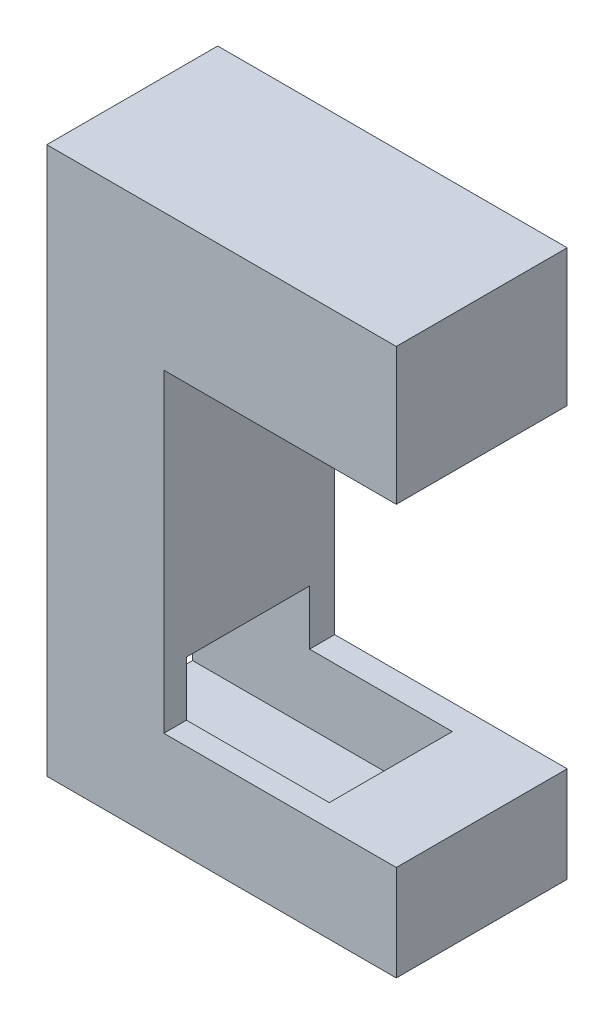
ISO-10303-21;
HEADER;
FILE_DESCRIPTION(('STEP AP214'),'2;1');
FILE_NAME('part.step','',(''),(''),'','','');
FILE_SCHEMA(('AUTOMOTIVE_DESIGN { 1 0 10303 214 1 1 1 1 }'));
ENDSEC;
DATA;
#1=APPLICATION_CONTEXT('core data for automotive mechanical design processes');
#2=APPLICATION_PROTOCOL_DEFINITION('international standard','automotive_design',2000,#1);
#3=PRODUCT_CONTEXT('',#1,'mechanical');
#4=PRODUCT('Part','Part','',(#3));
#5=PRODUCT_RELATED_PRODUCT_CATEGORY('part','',(#4));
#6=PRODUCT_DEFINITION_FORMATION('','',#4);
#7=PRODUCT_DEFINITION_CONTEXT('part definition',#1,'design');
#8=PRODUCT_DEFINITION('design','',#6,#7);
#9=PRODUCT_DEFINITION_SHAPE('','',#8);
#10=(LENGTH_UNIT() NAMED_UNIT(*) SI_UNIT(.MILLI.,.METRE.));
#11=(NAMED_UNIT(*) PLANE_ANGLE_UNIT() SI_UNIT($,.RADIAN.));
#12=(NAMED_UNIT(*) SI_UNIT($,.STERADIAN.) SOLID_ANGLE_UNIT());
#13=UNCERTAINTY_MEASURE_WITH_UNIT(LENGTH_MEASURE(1.E-05),#10,'distance_accuracy_value','');
#14=(GEOMETRIC_REPRESENTATION_CONTEXT(3) GLOBAL_UNCERTAINTY_ASSIGNED_CONTEXT((#13)) GLOBAL_UNIT_ASSIGNED_CONTEXT((#10,
#11,#12)) REPRESENTATION_CONTEXT('',''));
#15=CARTESIAN_POINT('',(0.,0.,0.));
#16=DIRECTION('',(0.,0.,1.));
#17=DIRECTION('',(1.,0.,0.));
#18=AXIS2_PLACEMENT_3D('',#15,#16,#17);
#19=CARTESIAN_POINT('',(51.4443980568339,20.4428266132375,12.5));
#20=DIRECTION('',(-1.,0.,0.));
#21=DIRECTION('',(0.,0.,1.));
#22=AXIS2_PLACEMENT_3D('',#19,#20,#21);
#23=PLANE('',#22);
#24=DIRECTION('',(0.,1.,0.));
#25=VECTOR('',#24,1.);
#26=CARTESIAN_POINT('',(51.4443980568339,20.4428266132375,0.));
#27=LINE('',#26,#25);
#28=CARTESIAN_POINT('',(51.4443980568339,10.4428266132375,0.));
#29=VERTEX_POINT('',#28);
#30=CARTESIAN_POINT('',(51.4443980568339,20.4428266132375,0.));
#31=VERTEX_POINT('',#30);
#32=EDGE_CURVE('E193',#29,#31,#27,.T.);
#33=ORIENTED_EDGE('',*,*,#32,.T.);
#34=DIRECTION('',(0.,0.,-1.));
#35=VECTOR('',#34,1.);
#36=CARTESIAN_POINT('',(51.4443980568339,20.4428266132375,12.5));
#37=LINE('',#36,#35);
#38=CARTESIAN_POINT('',(51.4443980568339,20.4428266132375,12.5));
#39=VERTEX_POINT('',#38);
#40=EDGE_CURVE('E273',#39,#31,#37,.T.);
#41=ORIENTED_EDGE('',*,*,#40,.F.);
#42=DIRECTION('',(0.,1.,0.));
#43=VECTOR('',#42,1.);
#44=CARTESIAN_POINT('',(51.4443980568339,20.4428266132375,12.5));
#45=LINE('',#44,#43);
#46=CARTESIAN_POINT('',(51.4443980568339,10.4428266132375,12.5));
#47=VERTEX_POINT('',#46);
#48=EDGE_CURVE('E194',#47,#39,#45,.T.);
#49=ORIENTED_EDGE('',*,*,#48,.F.);
#50=DIRECTION('',(0.,0.,-1.));
#51=VECTOR('',#50,1.);
#52=CARTESIAN_POINT('',(51.4443980568339,10.4428266132375,12.5));
#53=LINE('',#52,#51);
#54=EDGE_CURVE('E220',#47,#29,#53,.T.);
#55=ORIENTED_EDGE('',*,*,#54,.T.);
#56=EDGE_LOOP('',(#33,#41,#49,#55));
#57=FACE_BOUND('',#56,.T.);
#58=ADVANCED_FACE('F39',(#57),#23,.F.);
#59=CARTESIAN_POINT('',(51.4443980568339,20.4428266132375,12.5));
#60=DIRECTION('',(0.,-1.,0.));
#61=DIRECTION('',(1.,0.,0.));
#62=AXIS2_PLACEMENT_3D('',#59,#60,#61);
#63=PLANE('',#62);
#64=DIRECTION('',(-1.,0.,0.));
#65=VECTOR('',#64,1.);
#66=CARTESIAN_POINT('',(51.4443980568339,20.4428266132375,0.));
#67=LINE('',#66,#65);
#68=CARTESIAN_POINT('',(25.8861572956636,20.4428266132375,0.));
#69=VERTEX_POINT('',#68);
#70=EDGE_CURVE('E224',#31,#69,#67,.T.);
#71=ORIENTED_EDGE('',*,*,#70,.T.);
#72=DIRECTION('',(0.,0.,-1.));
#73=VECTOR('',#72,1.);
#74=CARTESIAN_POINT('',(25.8861572956636,20.4428266132375,12.5));
#75=LINE('',#74,#73);
#76=CARTESIAN_POINT('',(25.8861572956636,20.4428266132375,12.5));
#77=VERTEX_POINT('',#76);
#78=EDGE_CURVE('E269',#77,#69,#75,.T.);
#79=ORIENTED_EDGE('',*,*,#78,.F.);
#80=DIRECTION('',(-1.,0.,0.));
#81=VECTOR('',#80,1.);
#82=CARTESIAN_POINT('',(51.4443980568339,20.4428266132375,12.5));
#83=LINE('',#82,#81);
#84=EDGE_CURVE('E198',#39,#77,#83,.T.);
#85=ORIENTED_EDGE('',*,*,#84,.F.);
#86=ORIENTED_EDGE('',*,*,#40,.T.);
#87=EDGE_LOOP('',(#71,#79,#85,#86));
#88=FACE_BOUND('',#87,.T.);
#89=ADVANCED_FACE('F329',(#88),#63,.F.);
#90=CARTESIAN_POINT('',(25.8861572956636,20.4428266132375,12.5));
#91=DIRECTION('',(1.,0.,0.));
#92=DIRECTION('',(0.,1.,0.));
#93=AXIS2_PLACEMENT_3D('',#90,#91,#92);
#94=PLANE('',#93);
#95=DIRECTION('',(0.,0.,-1.));
#96=VECTOR('',#95,1.);
#97=CARTESIAN_POINT('',(25.8861572956636,-8.55717338676252,1.84263854797033));
#98=LINE('',#97,#96);
#99=CARTESIAN_POINT('',(25.8861572956636,-8.55717338676252,10.8426385479703));
#100=VERTEX_POINT('',#99);
#101=CARTESIAN_POINT('',(25.8861572956636,-8.55717338676252,1.84263854797033));
#102=VERTEX_POINT('',#101);
#103=EDGE_CURVE('E174',#100,#102,#98,.T.);
#104=ORIENTED_EDGE('',*,*,#103,.F.);
#105=DIRECTION('',(0.,1.,0.));
#106=VECTOR('',#105,1.);
#107=CARTESIAN_POINT('',(25.8861572956636,-8.55717338676252,10.8426385479703));
#108=LINE('',#107,#106);
#109=CARTESIAN_POINT('',(25.8861572956636,-17.5571733867625,10.8426385479703));
#110=VERTEX_POINT('',#109);
#111=EDGE_CURVE('E54',#110,#100,#108,.T.);
#112=ORIENTED_EDGE('',*,*,#111,.F.);
#113=DIRECTION('',(0.,0.,1.));
#114=VECTOR('',#113,1.);
#115=CARTESIAN_POINT('',(25.8861572956636,-17.5571733867625,1.84263854797033));
#116=LINE('',#115,#114);
#117=CARTESIAN_POINT('',(25.8861572956636,-17.5571733867625,1.84263854797033));
#118=VERTEX_POINT('',#117);
#119=EDGE_CURVE('E179',#118,#110,#116,.T.);
#120=ORIENTED_EDGE('',*,*,#119,.F.);
#121=DIRECTION('',(0.,-1.,0.));
#122=VECTOR('',#121,1.);
#123=CARTESIAN_POINT('',(25.8861572956636,-8.55717338676252,1.84263854797033));
#124=LINE('',#123,#122);
#125=EDGE_CURVE('E156',#102,#118,#124,.T.);
#126=ORIENTED_EDGE('',*,*,#125,.F.);
#127=EDGE_LOOP('',(#104,#112,#120,#126));
#128=FACE_BOUND('',#127,.T.);
#129=DIRECTION('',(0.,-1.,0.));
#130=VECTOR('',#129,1.);
#131=CARTESIAN_POINT('',(25.8861572956636,20.4428266132375,0.));
#132=LINE('',#131,#130);
#133=CARTESIAN_POINT('',(25.8861572956636,-19.5571733867625,0.));
#134=VERTEX_POINT('',#133);
#135=EDGE_CURVE('E227',#69,#134,#132,.T.);
#136=ORIENTED_EDGE('',*,*,#135,.T.);
#137=DIRECTION('',(0.,0.,-1.));
#138=VECTOR('',#137,1.);
#139=CARTESIAN_POINT('',(25.8861572956636,-19.5571733867625,12.5));
#140=LINE('',#139,#138);
#141=CARTESIAN_POINT('',(25.8861572956636,-19.5571733867625,12.5));
#142=VERTEX_POINT('',#141);
#143=EDGE_CURVE('E265',#142,#134,#140,.T.);
#144=ORIENTED_EDGE('',*,*,#143,.F.);
#145=DIRECTION('',(0.,-1.,0.));
#146=VECTOR('',#145,1.);
#147=CARTESIAN_POINT('',(25.8861572956636,20.4428266132375,12.5));
#148=LINE('',#147,#146);
#149=EDGE_CURVE('E202',#77,#142,#148,.T.);
#150=ORIENTED_EDGE('',*,*,#149,.F.);
#151=ORIENTED_EDGE('',*,*,#78,.T.);
#152=EDGE_LOOP('',(#136,#144,#150,#151));
#153=FACE_BOUND('',#152,.T.);
#154=ADVANCED_FACE('F327',(#128,#153),#94,.F.);
#155=CARTESIAN_POINT('',(25.8861572956636,-19.5571733867625,12.5));
#156=DIRECTION('',(0.,1.,0.));
#157=DIRECTION('',(-1.,0.,0.));
#158=AXIS2_PLACEMENT_3D('',#155,#156,#157);
#159=PLANE('',#158);
#160=DIRECTION('',(1.,0.,0.));
#161=VECTOR('',#160,1.);
#162=CARTESIAN_POINT('',(25.8861572956636,-19.5571733867625,0.));
#163=LINE('',#162,#161);
#164=CARTESIAN_POINT('',(51.444398056834,-19.5571733867625,0.));
#165=VERTEX_POINT('',#164);
#166=EDGE_CURVE('E230',#134,#165,#163,.T.);
#167=ORIENTED_EDGE('',*,*,#166,.T.);
#168=DIRECTION('',(0.,0.,-1.));
#169=VECTOR('',#168,1.);
#170=CARTESIAN_POINT('',(51.444398056834,-19.5571733867625,12.5));
#171=LINE('',#170,#169);
#172=CARTESIAN_POINT('',(51.444398056834,-19.5571733867625,12.5));
#173=VERTEX_POINT('',#172);
#174=EDGE_CURVE('E261',#173,#165,#171,.T.);
#175=ORIENTED_EDGE('',*,*,#174,.F.);
#176=DIRECTION('',(1.,0.,0.));
#177=VECTOR('',#176,1.);
#178=CARTESIAN_POINT('',(25.8861572956636,-19.5571733867625,12.5));
#179=LINE('',#178,#177);
#180=EDGE_CURVE('E205',#142,#173,#179,.T.);
#181=ORIENTED_EDGE('',*,*,#180,.F.);
#182=ORIENTED_EDGE('',*,*,#143,.T.);
#183=EDGE_LOOP('',(#167,#175,#181,#182));
#184=FACE_BOUND('',#183,.T.);
#185=ADVANCED_FACE('F323',(#184),#159,.F.);
#186=CARTESIAN_POINT('',(51.444398056834,-19.5571733867625,12.5));
#187=DIRECTION('',(-1.,0.,0.));
#188=DIRECTION('',(0.,-1.,0.));
#189=AXIS2_PLACEMENT_3D('',#186,#187,#188);
#190=PLANE('',#189);
#191=DIRECTION('',(0.,1.,0.));
#192=VECTOR('',#191,1.);
#193=CARTESIAN_POINT('',(51.444398056834,-19.5571733867625,0.));
#194=LINE('',#193,#192);
#195=CARTESIAN_POINT('',(51.444398056834,-12.5571733867625,0.));
#196=VERTEX_POINT('',#195);
#197=EDGE_CURVE('E233',#165,#196,#194,.T.);
#198=ORIENTED_EDGE('',*,*,#197,.T.);
#199=DIRECTION('',(0.,0.,-1.));
#200=VECTOR('',#199,1.);
#201=CARTESIAN_POINT('',(51.444398056834,-12.5571733867625,12.5));
#202=LINE('',#201,#200);
#203=CARTESIAN_POINT('',(51.444398056834,-12.5571733867625,12.5));
#204=VERTEX_POINT('',#203);
#205=EDGE_CURVE('E257',#204,#196,#202,.T.);
#206=ORIENTED_EDGE('',*,*,#205,.F.);
#207=DIRECTION('',(0.,1.,0.));
#208=VECTOR('',#207,1.);
#209=CARTESIAN_POINT('',(51.444398056834,-19.5571733867625,12.5));
#210=LINE('',#209,#208);
#211=EDGE_CURVE('E208',#173,#204,#210,.T.);
#212=ORIENTED_EDGE('',*,*,#211,.F.);
#213=ORIENTED_EDGE('',*,*,#174,.T.);
#214=EDGE_LOOP('',(#198,#206,#212,#213));
#215=FACE_BOUND('',#214,.T.);
#216=ADVANCED_FACE('F319',(#215),#190,.F.);
#217=CARTESIAN_POINT('',(51.444398056834,-12.5571733867625,12.5));
#218=DIRECTION('',(0.,-1.,0.));
#219=DIRECTION('',(1.,0.,0.));
#220=AXIS2_PLACEMENT_3D('',#217,#218,#219);
#221=PLANE('',#220);
#222=DIRECTION('',(0.,0.,-1.));
#223=VECTOR('',#222,1.);
#224=CARTESIAN_POINT('',(44.8861572956636,-12.5571733867625,12.5));
#225=LINE('',#224,#223);
#226=CARTESIAN_POINT('',(44.8861572956636,-12.5571733867625,10.8426385479703));
#227=VERTEX_POINT('',#226);
#228=CARTESIAN_POINT('',(44.8861572956636,-12.5571733867625,1.84263854797033));
#229=VERTEX_POINT('',#228);
#230=EDGE_CURVE('E11',#227,#229,#225,.T.);
#231=ORIENTED_EDGE('',*,*,#230,.F.);
#232=DIRECTION('',(-1.,0.,0.));
#233=VECTOR('',#232,1.);
#234=CARTESIAN_POINT('',(51.444398056834,-12.5571733867625,10.8426385479703));
#235=LINE('',#234,#233);
#236=CARTESIAN_POINT('',(34.444398056834,-12.5571733867625,10.8426385479703));
#237=VERTEX_POINT('',#236);
#238=EDGE_CURVE('E189',#227,#237,#235,.T.);
#239=ORIENTED_EDGE('',*,*,#238,.T.);
#240=DIRECTION('',(0.,0.,-1.));
#241=VECTOR('',#240,1.);
#242=CARTESIAN_POINT('',(34.444398056834,-12.5571733867625,12.5));
#243=LINE('',#242,#241);
#244=CARTESIAN_POINT('',(34.444398056834,-12.5571733867625,12.5));
#245=VERTEX_POINT('',#244);
#246=EDGE_CURVE('E253',#245,#237,#243,.T.);
#247=ORIENTED_EDGE('',*,*,#246,.F.);
#248=DIRECTION('',(-1.,0.,0.));
#249=VECTOR('',#248,1.);
#250=CARTESIAN_POINT('',(51.444398056834,-12.5571733867625,12.5));
#251=LINE('',#250,#249);
#252=EDGE_CURVE('E211',#204,#245,#251,.T.);
#253=ORIENTED_EDGE('',*,*,#252,.F.);
#254=ORIENTED_EDGE('',*,*,#205,.T.);
#255=DIRECTION('',(-1.,0.,0.));
#256=VECTOR('',#255,1.);
#257=CARTESIAN_POINT('',(51.444398056834,-12.5571733867625,0.));
#258=LINE('',#257,#256);
#259=CARTESIAN_POINT('',(34.444398056834,-12.5571733867625,0.));
#260=VERTEX_POINT('',#259);
#261=EDGE_CURVE('E236',#196,#260,#258,.T.);
#262=ORIENTED_EDGE('',*,*,#261,.T.);
#263=CARTESIAN_POINT('',(34.444398056834,-12.5571733867625,1.84263854797033));
#264=VERTEX_POINT('',#263);
#265=EDGE_CURVE('E252',#264,#260,#243,.T.);
#266=ORIENTED_EDGE('',*,*,#265,.F.);
#267=DIRECTION('',(1.,0.,0.));
#268=VECTOR('',#267,1.);
#269=CARTESIAN_POINT('',(51.444398056834,-12.5571733867625,1.84263854797033));
#270=LINE('',#269,#268);
#271=EDGE_CURVE('E183',#264,#229,#270,.T.);
#272=ORIENTED_EDGE('',*,*,#271,.T.);
#273=EDGE_LOOP('',(#231,#239,#247,#253,#254,#262,#266,#272));
#274=FACE_BOUND('',#273,.T.);
#275=ADVANCED_FACE('F292',(#274),#221,.F.);
#276=CARTESIAN_POINT('',(34.444398056834,-12.5571733867625,12.5));
#277=DIRECTION('',(-1.,0.,0.));
#278=DIRECTION('',(0.,-1.,0.));
#279=AXIS2_PLACEMENT_3D('',#276,#277,#278);
#280=PLANE('',#279);
#281=ORIENTED_EDGE('',*,*,#246,.T.);
#282=DIRECTION('',(0.,1.,0.));
#283=VECTOR('',#282,1.);
#284=CARTESIAN_POINT('',(34.444398056834,-12.5571733867625,10.8426385479703));
#285=LINE('',#284,#283);
#286=CARTESIAN_POINT('',(34.444398056834,-8.55717338676252,10.8426385479703));
#287=VERTEX_POINT('',#286);
#288=EDGE_CURVE('E47',#237,#287,#285,.T.);
#289=ORIENTED_EDGE('',*,*,#288,.T.);
#290=DIRECTION('',(0.,0.,-1.));
#291=VECTOR('',#290,1.);
#292=CARTESIAN_POINT('',(34.444398056834,-8.55717338676252,12.5));
#293=LINE('',#292,#291);
#294=CARTESIAN_POINT('',(34.444398056834,-8.55717338676252,1.84263854797033));
#295=VERTEX_POINT('',#294);
#296=EDGE_CURVE('E277',#287,#295,#293,.T.);
#297=ORIENTED_EDGE('',*,*,#296,.T.);
#298=DIRECTION('',(0.,-1.,0.));
#299=VECTOR('',#298,1.);
#300=CARTESIAN_POINT('',(34.444398056834,-12.5571733867625,1.84263854797033));
#301=LINE('',#300,#299);
#302=EDGE_CURVE('E281',#295,#264,#301,.T.);
#303=ORIENTED_EDGE('',*,*,#302,.T.);
#304=ORIENTED_EDGE('',*,*,#265,.T.);
#305=DIRECTION('',(0.,1.,0.));
#306=VECTOR('',#305,1.);
#307=CARTESIAN_POINT('',(34.444398056834,-12.5571733867625,0.));
#308=LINE('',#307,#306);
#309=CARTESIAN_POINT('',(34.444398056834,10.4428266132375,0.));
#310=VERTEX_POINT('',#309);
#311=EDGE_CURVE('E240',#260,#310,#308,.T.);
#312=ORIENTED_EDGE('',*,*,#311,.T.);
#313=DIRECTION('',(0.,0.,-1.));
#314=VECTOR('',#313,1.);
#315=CARTESIAN_POINT('',(34.444398056834,10.4428266132375,12.5));
#316=LINE('',#315,#314);
#317=CARTESIAN_POINT('',(34.444398056834,10.4428266132375,12.5));
#318=VERTEX_POINT('',#317);
#319=EDGE_CURVE('E248',#318,#310,#316,.T.);
#320=ORIENTED_EDGE('',*,*,#319,.F.);
#321=DIRECTION('',(0.,1.,0.));
#322=VECTOR('',#321,1.);
#323=CARTESIAN_POINT('',(34.444398056834,-12.5571733867625,12.5));
#324=LINE('',#323,#322);
#325=EDGE_CURVE('E214',#245,#318,#324,.T.);
#326=ORIENTED_EDGE('',*,*,#325,.F.);
#327=EDGE_LOOP('',(#281,#289,#297,#303,#304,#312,#320,#326));
#328=FACE_BOUND('',#327,.T.);
#329=ADVANCED_FACE('F287',(#328),#280,.F.);
#330=CARTESIAN_POINT('',(34.444398056834,10.4428266132375,12.5));
#331=DIRECTION('',(0.,1.,0.));
#332=DIRECTION('',(-1.,0.,0.));
#333=AXIS2_PLACEMENT_3D('',#330,#331,#332);
#334=PLANE('',#333);
#335=DIRECTION('',(1.,0.,0.));
#336=VECTOR('',#335,1.);
#337=CARTESIAN_POINT('',(34.444398056834,10.4428266132375,0.));
#338=LINE('',#337,#336);
#339=EDGE_CURVE('E199',#310,#29,#338,.T.);
#340=ORIENTED_EDGE('',*,*,#339,.T.);
#341=ORIENTED_EDGE('',*,*,#54,.F.);
#342=DIRECTION('',(1.,0.,0.));
#343=VECTOR('',#342,1.);
#344=CARTESIAN_POINT('',(34.444398056834,10.4428266132375,12.5));
#345=LINE('',#344,#343);
#346=EDGE_CURVE('E217',#318,#47,#345,.T.);
#347=ORIENTED_EDGE('',*,*,#346,.F.);
#348=ORIENTED_EDGE('',*,*,#319,.T.);
#349=EDGE_LOOP('',(#340,#341,#347,#348));
#350=FACE_BOUND('',#349,.T.);
#351=ADVANCED_FACE('F307',(#350),#334,.F.);
#352=CARTESIAN_POINT('',(0.,0.,12.5));
#353=DIRECTION('',(0.,0.,1.));
#354=DIRECTION('',(1.,0.,0.));
#355=AXIS2_PLACEMENT_3D('',#352,#353,#354);
#356=PLANE('',#355);
#357=ORIENTED_EDGE('',*,*,#48,.T.);
#358=ORIENTED_EDGE('',*,*,#84,.T.);
#359=ORIENTED_EDGE('',*,*,#149,.T.);
#360=ORIENTED_EDGE('',*,*,#180,.T.);
#361=ORIENTED_EDGE('',*,*,#211,.T.);
#362=ORIENTED_EDGE('',*,*,#252,.T.);
#363=ORIENTED_EDGE('',*,*,#325,.T.);
#364=ORIENTED_EDGE('',*,*,#346,.T.);
#365=EDGE_LOOP('',(#357,#358,#359,#360,#361,#362,#363,#364));
#366=FACE_BOUND('',#365,.T.);
#367=ADVANCED_FACE('F313',(#366),#356,.T.);
#368=CARTESIAN_POINT('',(0.,0.,0.));
#369=DIRECTION('',(0.,0.,1.));
#370=DIRECTION('',(1.,0.,0.));
#371=AXIS2_PLACEMENT_3D('',#368,#369,#370);
#372=PLANE('',#371);
#373=ORIENTED_EDGE('',*,*,#32,.F.);
#374=ORIENTED_EDGE('',*,*,#339,.F.);
#375=ORIENTED_EDGE('',*,*,#311,.F.);
#376=ORIENTED_EDGE('',*,*,#261,.F.);
#377=ORIENTED_EDGE('',*,*,#197,.F.);
#378=ORIENTED_EDGE('',*,*,#166,.F.);
#379=ORIENTED_EDGE('',*,*,#135,.F.);
#380=ORIENTED_EDGE('',*,*,#70,.F.);
#381=EDGE_LOOP('',(#373,#374,#375,#376,#377,#378,#379,#380));
#382=FACE_BOUND('',#381,.T.);
#383=ADVANCED_FACE('F304',(#382),#372,.F.);
#384=CARTESIAN_POINT('',(44.8861572956636,0.,0.));
#385=DIRECTION('',(-1.,0.,0.));
#386=DIRECTION('',(0.,-1.,0.));
#387=AXIS2_PLACEMENT_3D('',#384,#385,#386);
#388=PLANE('',#387);
#389=ORIENTED_EDGE('',*,*,#230,.T.);
#390=DIRECTION('',(0.,-1.,0.));
#391=VECTOR('',#390,1.);
#392=CARTESIAN_POINT('',(44.8861572956636,-8.55717338676251,1.84263854797033));
#393=LINE('',#392,#391);
#394=CARTESIAN_POINT('',(44.8861572956636,-17.5571733867625,1.84263854797033));
#395=VERTEX_POINT('',#394);
#396=EDGE_CURVE('E140',#229,#395,#393,.T.);
#397=ORIENTED_EDGE('',*,*,#396,.T.);
#398=DIRECTION('',(0.,0.,1.));
#399=VECTOR('',#398,1.);
#400=CARTESIAN_POINT('',(44.8861572956636,-17.5571733867625,1.84263854797033));
#401=LINE('',#400,#399);
#402=CARTESIAN_POINT('',(44.8861572956636,-17.5571733867625,10.8426385479703));
#403=VERTEX_POINT('',#402);
#404=EDGE_CURVE('E145',#395,#403,#401,.T.);
#405=ORIENTED_EDGE('',*,*,#404,.T.);
#406=DIRECTION('',(0.,1.,0.));
#407=VECTOR('',#406,1.);
#408=CARTESIAN_POINT('',(44.8861572956636,-8.55717338676251,10.8426385479703));
#409=LINE('',#408,#407);
#410=EDGE_CURVE('E150',#403,#227,#409,.T.);
#411=ORIENTED_EDGE('',*,*,#410,.T.);
#412=EDGE_LOOP('',(#389,#397,#405,#411));
#413=FACE_BOUND('',#412,.T.);
#414=ADVANCED_FACE('F142',(#413),#388,.T.);
#415=CARTESIAN_POINT('',(44.8861572956636,-8.55717338676251,10.8426385479703));
#416=DIRECTION('',(0.,0.,1.));
#417=DIRECTION('',(0.,-1.,0.));
#418=AXIS2_PLACEMENT_3D('',#415,#416,#417);
#419=PLANE('',#418);
#420=ORIENTED_EDGE('',*,*,#410,.F.);
#421=DIRECTION('',(-1.,0.,0.));
#422=VECTOR('',#421,1.);
#423=CARTESIAN_POINT('',(44.8861572956636,-17.5571733867625,10.8426385479703));
#424=LINE('',#423,#422);
#425=EDGE_CURVE('E161',#403,#110,#424,.T.);
#426=ORIENTED_EDGE('',*,*,#425,.T.);
#427=ORIENTED_EDGE('',*,*,#111,.T.);
#428=DIRECTION('',(-1.,0.,0.));
#429=VECTOR('',#428,1.);
#430=CARTESIAN_POINT('',(44.8861572956636,-8.55717338676251,10.8426385479703));
#431=LINE('',#430,#429);
#432=EDGE_CURVE('E166',#287,#100,#431,.T.);
#433=ORIENTED_EDGE('',*,*,#432,.F.);
#434=ORIENTED_EDGE('',*,*,#288,.F.);
#435=ORIENTED_EDGE('',*,*,#238,.F.);
#436=EDGE_LOOP('',(#420,#426,#427,#433,#434,#435));
#437=FACE_BOUND('',#436,.T.);
#438=ADVANCED_FACE('F290',(#437),#419,.F.);
#439=CARTESIAN_POINT('',(44.8861572956636,-8.55717338676251,1.84263854797033));
#440=DIRECTION('',(0.,0.,-1.));
#441=DIRECTION('',(0.,1.,0.));
#442=AXIS2_PLACEMENT_3D('',#439,#440,#441);
#443=PLANE('',#442);
#444=ORIENTED_EDGE('',*,*,#302,.F.);
#445=DIRECTION('',(-1.,0.,0.));
#446=VECTOR('',#445,1.);
#447=CARTESIAN_POINT('',(44.8861572956636,-8.55717338676251,1.84263854797033));
#448=LINE('',#447,#446);
#449=EDGE_CURVE('E62',#295,#102,#448,.T.);
#450=ORIENTED_EDGE('',*,*,#449,.T.);
#451=ORIENTED_EDGE('',*,*,#125,.T.);
#452=DIRECTION('',(-1.,0.,0.));
#453=VECTOR('',#452,1.);
#454=CARTESIAN_POINT('',(44.8861572956636,-17.5571733867625,1.84263854797033));
#455=LINE('',#454,#453);
#456=EDGE_CURVE('E153',#395,#118,#455,.T.);
#457=ORIENTED_EDGE('',*,*,#456,.F.);
#458=ORIENTED_EDGE('',*,*,#396,.F.);
#459=ORIENTED_EDGE('',*,*,#271,.F.);
#460=EDGE_LOOP('',(#444,#450,#451,#457,#458,#459));
#461=FACE_BOUND('',#460,.T.);
#462=ADVANCED_FACE('F154',(#461),#443,.F.);
#463=CARTESIAN_POINT('',(44.8861572956636,-8.55717338676251,1.84263854797033));
#464=DIRECTION('',(0.,1.,0.));
#465=DIRECTION('',(-1.,0.,0.));
#466=AXIS2_PLACEMENT_3D('',#463,#464,#465);
#467=PLANE('',#466);
#468=ORIENTED_EDGE('',*,*,#432,.T.);
#469=ORIENTED_EDGE('',*,*,#103,.T.);
#470=ORIENTED_EDGE('',*,*,#449,.F.);
#471=ORIENTED_EDGE('',*,*,#296,.F.);
#472=EDGE_LOOP('',(#468,#469,#470,#471));
#473=FACE_BOUND('',#472,.T.);
#474=ADVANCED_FACE('F354',(#473),#467,.F.);
#475=CARTESIAN_POINT('',(44.8861572956636,-17.5571733867625,1.84263854797033));
#476=DIRECTION('',(0.,-1.,0.));
#477=DIRECTION('',(1.,0.,0.));
#478=AXIS2_PLACEMENT_3D('',#475,#476,#477);
#479=PLANE('',#478);
#480=ORIENTED_EDGE('',*,*,#119,.T.);
#481=ORIENTED_EDGE('',*,*,#425,.F.);
#482=ORIENTED_EDGE('',*,*,#404,.F.);
#483=ORIENTED_EDGE('',*,*,#456,.T.);
#484=EDGE_LOOP('',(#480,#481,#482,#483));
#485=FACE_BOUND('',#484,.T.);
#486=ADVANCED_FACE('F163',(#485),#479,.F.);
#487=CLOSED_SHELL('',(#58,#89,#154,#185,#216,#275,#329,#351,#367,#383,#414,#438,#462,#474,#486));
#488=MANIFOLD_SOLID_BREP('B2',#487);
#489=ADVANCED_BREP_SHAPE_REPRESENTATION('',(#18,#488),#14);
#490=SHAPE_DEFINITION_REPRESENTATION(#9,#489);
ENDSEC;
END-ISO-10303-21;
